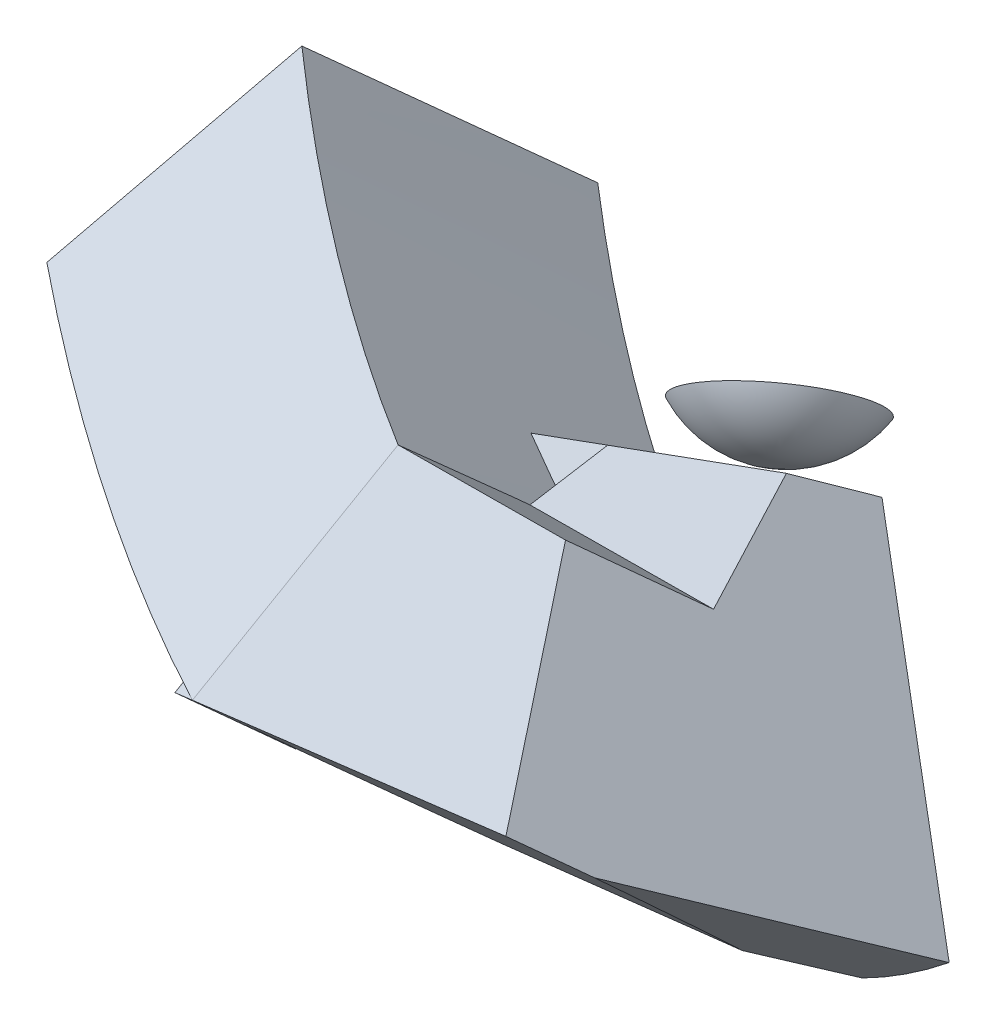
ISO-10303-21;
HEADER;
FILE_DESCRIPTION(('STEP AP214'),'2;1');
FILE_NAME('part.step','',(''),(''),'','','');
FILE_SCHEMA(('AUTOMOTIVE_DESIGN { 1 0 10303 214 1 1 1 1 }'));
ENDSEC;
DATA;
#1=APPLICATION_CONTEXT('core data for automotive mechanical design processes');
#2=APPLICATION_PROTOCOL_DEFINITION('international standard','automotive_design',2000,#1);
#3=PRODUCT_CONTEXT('',#1,'mechanical');
#4=PRODUCT('Part','Part','',(#3));
#5=PRODUCT_RELATED_PRODUCT_CATEGORY('part','',(#4));
#6=PRODUCT_DEFINITION_FORMATION('','',#4);
#7=PRODUCT_DEFINITION_CONTEXT('part definition',#1,'design');
#8=PRODUCT_DEFINITION('design','',#6,#7);
#9=PRODUCT_DEFINITION_SHAPE('','',#8);
#10=(LENGTH_UNIT() NAMED_UNIT(*) SI_UNIT(.MILLI.,.METRE.));
#11=(NAMED_UNIT(*) PLANE_ANGLE_UNIT() SI_UNIT($,.RADIAN.));
#12=(NAMED_UNIT(*) SI_UNIT($,.STERADIAN.) SOLID_ANGLE_UNIT());
#13=UNCERTAINTY_MEASURE_WITH_UNIT(LENGTH_MEASURE(1.E-05),#10,'distance_accuracy_value','');
#14=(GEOMETRIC_REPRESENTATION_CONTEXT(3) GLOBAL_UNCERTAINTY_ASSIGNED_CONTEXT((#13)) GLOBAL_UNIT_ASSIGNED_CONTEXT((#10,
#11,#12)) REPRESENTATION_CONTEXT('',''));
#15=CARTESIAN_POINT('',(0.,0.,0.));
#16=DIRECTION('',(0.,0.,1.));
#17=DIRECTION('',(1.,0.,0.));
#18=AXIS2_PLACEMENT_3D('',#15,#16,#17);
#19=CARTESIAN_POINT('',(-512.21458623228,908.307300803401,4054.79413164876));
#20=DIRECTION('',(0.448319909818911,-0.679127077041244,0.581201919894781));
#21=DIRECTION('',(-0.288113592040315,0.505718117307448,0.813166492121163));
#22=AXIS2_PLACEMENT_3D('',#19,#20,#21);
#23=SPHERICAL_SURFACE('',#22,11.9999999999994);
#24=CARTESIAN_POINT('',(-509.240768378449,903.802481404368,4058.64938904021));
#25=DIRECTION('',(0.448319909818911,-0.679127077041244,0.581201919894781));
#26=DIRECTION('',(0.,-0.650206241957508,-0.759757752786699));
#27=AXIS2_PLACEMENT_3D('',#24,#25,#26);
#28=CIRCLE('',#27,9.9999999999995);
#29=CARTESIAN_POINT('',(-509.240768378449,897.300418984793,4051.05181151235));
#30=VERTEX_POINT('',#29);
#31=EDGE_CURVE('P0_E10',#30,#30,#28,.T.);
#32=ORIENTED_EDGE('',*,*,#31,.T.);
#33=EDGE_LOOP('',(#32));
#34=FACE_BOUND('',#33,.T.);
#35=ADVANCED_FACE('P0_F15',(#34),#23,.T.);
#36=CARTESIAN_POINT('',(-512.121904298853,908.859662577442,4066.78105396142));
#37=DIRECTION('',(0.448319909818911,-0.679127077041244,0.581201919894781));
#38=DIRECTION('',(0.,-0.650206241957508,-0.759757752786699));
#39=AXIS2_PLACEMENT_3D('',#36,#37,#38);
#40=PLANE('',#39);
#41=ORIENTED_EDGE('',*,*,#31,.F.);
#42=EDGE_LOOP('',(#41));
#43=FACE_BOUND('',#42,.T.);
#44=ADVANCED_FACE('P0_F23',(#43),#40,.F.);
#45=CLOSED_SHELL('',(#35,#44));
#46=MANIFOLD_SOLID_BREP('P0_B1',#45);
#47=CARTESIAN_POINT('',(-833.082850345083,2376.22339583199,1397.6069230379));
#48=DIRECTION('',(-0.288202576589418,0.82622503646678,0.484036634938606));
#49=DIRECTION('',(0.,-0.505484619205064,0.86283561571548));
#50=AXIS2_PLACEMENT_3D('',#47,#48,#49);
#51=PLANE('',#50);
#52=CARTESIAN_POINT('',(-528.87399359729,891.91854264907,4112.36756910259));
#53=CARTESIAN_POINT('',(-528.403556927149,891.896041024064,4112.68608314733));
#54=CARTESIAN_POINT('',(-527.931596049871,891.875353123319,4113.0024087958));
#55=CARTESIAN_POINT('',(-526.984625881041,891.837604770354,4113.63068330018));
#56=CARTESIAN_POINT('',(-526.509616589488,891.820544318133,4113.94263215609));
#57=CARTESIAN_POINT('',(-526.033083090799,891.805297590174,4114.25239261572));
#58=B_SPLINE_CURVE_WITH_KNOTS('',3,(#52,#53,#54,#55,#56,#57),.UNSPECIFIED.,.F.,.F.,(4,2,4),(0.,
1.70561800329302,3.41123600658561),.UNSPECIFIED.);
#59=CARTESIAN_POINT('',(-528.573064890401,891.904407346218,4112.57087472598));
#60=VERTEX_POINT('',#59);
#61=CARTESIAN_POINT('',(-526.033083090799,891.805297590173,4114.25239261572));
#62=VERTEX_POINT('',#61);
#63=EDGE_CURVE('P1_E236',#60,#62,#58,.T.);
#64=ORIENTED_EDGE('',*,*,#63,.F.);
#65=DIRECTION('',(-0.00763907318680661,-0.507452326818731,0.86164597171176));
#66=VECTOR('',#65,1.);
#67=CARTESIAN_POINT('',(-528.584492443726,891.145291890328,4113.85984068409));
#68=LINE('',#67,#66);
#69=CARTESIAN_POINT('',(-528.584492443726,891.145291890328,4113.85984068409));
#70=VERTEX_POINT('',#69);
#71=EDGE_CURVE('P1_E156',#60,#70,#68,.T.);
#72=ORIENTED_EDGE('',*,*,#71,.T.);
#73=DIRECTION('',(0.957567718294367,0.247706292734628,0.147328399910497));
#74=VECTOR('',#73,1.);
#75=CARTESIAN_POINT('',(-480.334300183112,903.626786431412,4121.2834656511));
#76=LINE('',#75,#74);
#77=EDGE_CURVE('P1_E239',#70,#62,#76,.T.);
#78=ORIENTED_EDGE('',*,*,#77,.T.);
#79=EDGE_LOOP('',(#64,#72,#78));
#80=FACE_BOUND('',#79,.T.);
#81=ADVANCED_FACE('P1_F16',(#80),#51,.T.);
#82=CARTESIAN_POINT('',(-521.189002197683,882.019294288321,4102.996006564));
#83=DIRECTION('',(-0.876135399921251,-0.411945026758972,-0.250375829371327));
#84=DIRECTION('',(0.425497672250812,-0.904959518933936,0.));
#85=AXIS2_PLACEMENT_3D('',#82,#83,#84);
#86=PLANE('',#85);
#87=DIRECTION('',(0.369702593409668,-0.240871643450661,-0.897385560284732));
#88=VECTOR('',#87,1.);
#89=CARTESIAN_POINT('',(-521.559726110383,883.072388693296,4102.56061046527));
#90=LINE('',#89,#88);
#91=CARTESIAN_POINT('',(-522.582313084415,883.738632883618,4105.04275368252));
#92=VERTEX_POINT('',#91);
#93=CARTESIAN_POINT('',(-522.376395497141,883.604471780759,4104.54292632745));
#94=VERTEX_POINT('',#93);
#95=EDGE_CURVE('P1_E39',#92,#94,#90,.T.);
#96=ORIENTED_EDGE('',*,*,#95,.F.);
#97=DIRECTION('',(-0.462218140377722,0.570374850125397,0.678989632505675));
#98=VECTOR('',#97,1.);
#99=CARTESIAN_POINT('',(-521.189002197683,882.019294288321,4102.996006564));
#100=LINE('',#99,#98);
#101=EDGE_CURVE('P1_E249',#92,#70,#100,.T.);
#102=ORIENTED_EDGE('',*,*,#101,.T.);
#103=ORIENTED_EDGE('',*,*,#71,.F.);
#104=CARTESIAN_POINT('',(-521.189002197684,882.019294288322,4102.996006564));
#105=CARTESIAN_POINT('',(-521.828015691035,882.871940636578,4103.82922964439));
#106=CARTESIAN_POINT('',(-522.467157415289,883.725466396533,4104.6614545388));
#107=CARTESIAN_POINT('',(-523.745700793958,885.434315004411,4106.32385713546));
#108=CARTESIAN_POINT('',(-524.385102448378,886.289637852375,4107.15403483766));
#109=CARTESIAN_POINT('',(-526.30372855818,888.858394300712,4109.64145469654));
#110=CARTESIAN_POINT('',(-527.583348089032,890.574581021217,4111.29554960638));
#111=CARTESIAN_POINT('',(-528.863508195864,892.294591508203,4112.94524487494));
#112=B_SPLINE_CURVE_WITH_KNOTS('',3,(#104,#105,#106,#107,#108,#109,#110,#111),.UNSPECIFIED.,.F.,
.F.,(4,2,2,4),(0.,4.05788582848137,8.11577174966471,16.2317091512372),.UNSPECIFIED.);
#113=EDGE_CURVE('P1_E247',#94,#60,#112,.T.);
#114=ORIENTED_EDGE('',*,*,#113,.F.);
#115=EDGE_LOOP('',(#96,#102,#103,#114));
#116=FACE_BOUND('',#115,.T.);
#117=ADVANCED_FACE('P1_F209',(#116),#86,.T.);
#118=CARTESIAN_POINT('',(104.18712353213,-1092.15959613354,640.858415283076));
#119=DIRECTION('',(-0.0819998212514932,0.859577351067142,-0.504383590977262));
#120=DIRECTION('',(0.,0.506087920948013,0.862481893300096));
#121=AXIS2_PLACEMENT_3D('',#118,#119,#120);
#122=PLANE('',#121);
#123=CARTESIAN_POINT('',(-488.579718278092,872.504566107842,4085.43437387442));
#124=DIRECTION('',(-0.0819998212514932,0.859577351067142,-0.504383590977262));
#125=DIRECTION('',(-0.918683892673464,-0.261399177230708,-0.296125607615149));
#126=AXIS2_PLACEMENT_3D('',#123,#124,#125);
#127=ELLIPSE('',#126,1.09448333379449,1.00000000000003);
#128=CARTESIAN_POINT('',(-489.585202487649,872.218469064895,4085.11026933217));
#129=VERTEX_POINT('',#128);
#130=EDGE_CURVE('P1_E139',#129,#129,#127,.F.);
#131=ORIENTED_EDGE('',*,*,#130,.F.);
#132=EDGE_LOOP('',(#131));
#133=FACE_BOUND('',#132,.T.);
#134=CARTESIAN_POINT('',(-501.462479934908,866.761213657524,4077.74088106097));
#135=DIRECTION('',(0.955164739682771,0.212245775641599,0.206426865473075));
#136=VECTOR('',#135,1.);
#137=LINE('',#134,#136);
#138=CARTESIAN_POINT('',(-501.462479934908,866.761213657524,4077.74088106097));
#139=VERTEX_POINT('',#138);
#140=CARTESIAN_POINT('',(-473.99732031167,872.864207062925,4083.67655537473));
#141=VERTEX_POINT('',#140);
#142=EDGE_CURVE('P1_E158',#139,#141,#137,.T.);
#143=ORIENTED_EDGE('',*,*,#142,.T.);
#144=CARTESIAN_POINT('',(-181.249792145028,364.476801277761,3169.68261740982));
#145=DIRECTION('',(-0.0819998212514932,0.859577351067142,-0.504383590977262));
#146=DIRECTION('',(0.284493144700325,-0.464842455305755,-0.838442092433244));
#147=AXIS2_PLACEMENT_3D('',#144,#145,#146);
#148=ELLIPSE('',#147,1141.52248423801,54.9999999999997);
#149=CARTESIAN_POINT('',(-479.191340199723,878.004856819262,4093.28173462595));
#150=VERTEX_POINT('',#149);
#151=EDGE_CURVE('P1_E133',#141,#150,#148,.F.);
#152=ORIENTED_EDGE('',*,*,#151,.T.);
#153=DIRECTION('',(0.996257713804592,0.056821740568262,-0.0651295438617623));
#154=VECTOR('',#153,1.);
#155=CARTESIAN_POINT('',(212.31300907158,917.444933610301,4048.07519597395));
#156=LINE('',#155,#154);
#157=CARTESIAN_POINT('',(-507.360527333272,876.398222088967,4095.12327249666));
#158=VERTEX_POINT('',#157);
#159=EDGE_CURVE('P1_E253',#158,#150,#156,.T.);
#160=ORIENTED_EDGE('',*,*,#159,.F.);
#161=DIRECTION('',(0.284493144700321,-0.464842455305756,-0.838442092433245));
#162=VECTOR('',#161,1.);
#163=CARTESIAN_POINT('',(626.416181183715,-976.11583237331,753.720734159905));
#164=LINE('',#163,#162);
#165=EDGE_CURVE('P1_E369',#158,#139,#164,.T.);
#166=ORIENTED_EDGE('',*,*,#165,.T.);
#167=EDGE_LOOP('',(#143,#152,#160,#166));
#168=FACE_BOUND('',#167,.T.);
#169=ADVANCED_FACE('P1_F206',(#133,#168),#122,.F.);
#170=CARTESIAN_POINT('',(626.416181183714,-976.11583237331,753.720734159905));
#171=DIRECTION('',(0.0995613497239741,0.884178273414533,-0.456416825350288));
#172=DIRECTION('',(0.284493144700321,-0.464842455305756,-0.838442092433245));
#173=AXIS2_PLACEMENT_3D('',#170,#171,#172);
#174=PLANE('',#173);
#175=CARTESIAN_POINT('',(-167.70231589908,340.697276914296,3131.44647013888));
#176=DIRECTION('',(0.0995613497239741,0.884178273414533,-0.456416825350288));
#177=DIRECTION('',(0.293152904280769,-0.464401511506518,-0.835698875685622));
#178=AXIS2_PLACEMENT_3D('',#175,#176,#177);
#179=ELLIPSE('',#178,1162.3698636846,54.9999999999997);
#180=CARTESIAN_POINT('',(-511.523106333974,866.225877646424,4074.50922540888));
#181=VERTEX_POINT('',#180);
#182=CARTESIAN_POINT('',(-511.730275867598,878.174460773659,4097.61102826794));
#183=VERTEX_POINT('',#182);
#184=EDGE_CURVE('P1_E504',#181,#183,#179,.T.);
#185=ORIENTED_EDGE('',*,*,#184,.F.);
#186=DIRECTION('',(0.950867452567859,0.0505966098879775,0.305435870052869));
#187=VECTOR('',#186,1.);
#188=CARTESIAN_POINT('',(-535.746203059682,864.93694239893,4066.72832744691));
#189=LINE('',#188,#187);
#190=EDGE_CURVE('P1_E371',#139,#181,#189,.F.);
#191=ORIENTED_EDGE('',*,*,#190,.F.);
#192=ORIENTED_EDGE('',*,*,#165,.F.);
#193=DIRECTION('',(0.819411245429362,-0.333078652323059,-0.466501685131529));
#194=VECTOR('',#193,1.);
#195=CARTESIAN_POINT('',(2036.77387962972,-157.755097537409,2646.71382648345));
#196=LINE('',#195,#194);
#197=EDGE_CURVE('P1_E243',#158,#183,#196,.F.);
#198=ORIENTED_EDGE('',*,*,#197,.T.);
#199=EDGE_LOOP('',(#185,#191,#192,#198));
#200=FACE_BOUND('',#199,.T.);
#201=ADVANCED_FACE('P1_F18',(#200),#174,.F.);
#202=CARTESIAN_POINT('',(-1123.26766999078,1971.64183500435,3170.28996949122));
#203=DIRECTION('',(-0.288113592040319,0.505718117307454,0.813166492121158));
#204=DIRECTION('',(0.,-0.84917469231837,0.528112054327489));
#205=AXIS2_PLACEMENT_3D('',#202,#203,#204);
#206=PLANE('',#205);
#207=DIRECTION('',(0.713856549293143,-0.452583404821623,0.534394132369877));
#208=VECTOR('',#207,1.);
#209=CARTESIAN_POINT('',(-497.493840770239,900.845599238658,4057.94951905041));
#210=LINE('',#209,#208);
#211=CARTESIAN_POINT('',(-496.663122902028,900.318926027337,4058.5713957494));
#212=VERTEX_POINT('',#211);
#213=CARTESIAN_POINT('',(-463.715181623168,879.43000729343,4083.23627626429));
#214=VERTEX_POINT('',#213);
#215=EDGE_CURVE('P1_E146',#212,#214,#210,.T.);
#216=ORIENTED_EDGE('',*,*,#215,.T.);
#217=CARTESIAN_POINT('',(-493.759260831532,913.016351340969,4051.70358215101));
#218=DIRECTION('',(-0.288113592040319,0.505718117307454,0.813166492121158));
#219=DIRECTION('',(0.,0.849174692318371,-0.528112054327489));
#220=AXIS2_PLACEMENT_3D('',#217,#218,#219);
#221=CIRCLE('',#220,54.9999999999997);
#222=EDGE_CURVE('P1_E130',#141,#214,#221,.T.);
#223=ORIENTED_EDGE('',*,*,#222,.F.);
#224=ORIENTED_EDGE('',*,*,#142,.F.);
#225=ORIENTED_EDGE('',*,*,#190,.T.);
#226=CARTESIAN_POINT('',(-463.076254963678,993.836260449731,4012.31201652377));
#227=DIRECTION('',(0.288113592040326,-0.505718117307455,-0.813166492121155));
#228=DIRECTION('',(-0.322979009135307,-0.850735885355375,0.414648059234071));
#229=AXIS2_PLACEMENT_3D('',#226,#227,#228);
#230=CIRCLE('',#229,150.000000000001);
#231=CARTESIAN_POINT('',(-553.275422059531,880.373717874749,4050.91721938084));
#232=VERTEX_POINT('',#231);
#233=EDGE_CURVE('P1_E447',#181,#232,#230,.T.);
#234=ORIENTED_EDGE('',*,*,#233,.T.);
#235=DIRECTION('',(-0.182337919390171,-0.862610796518032,0.471863854181468));
#236=VECTOR('',#235,1.);
#237=CARTESIAN_POINT('',(-549.401152556977,898.702251581288,4040.89117682355));
#238=LINE('',#237,#236);
#239=CARTESIAN_POINT('',(-549.401152556977,898.702251581288,4040.89117682355));
#240=VERTEX_POINT('',#239);
#241=EDGE_CURVE('P1_E445',#240,#232,#238,.T.);
#242=ORIENTED_EDGE('',*,*,#241,.F.);
#243=CARTESIAN_POINT('',(-463.076254963678,993.836260449731,4012.31201652377));
#244=DIRECTION('',(0.288113592040326,-0.505718117307455,-0.813166492121155));
#245=DIRECTION('',(-0.390211687000233,-0.837476506303705,0.382580632962221));
#246=AXIS2_PLACEMENT_3D('',#243,#244,#245);
#247=CIRCLE('',#246,131.602568330999);
#248=CARTESIAN_POINT('',(-526.59634348304,887.223890088536,4056.10969719039));
#249=VERTEX_POINT('',#248);
#250=EDGE_CURVE('P1_E448',#249,#240,#247,.T.);
#251=ORIENTED_EDGE('',*,*,#250,.F.);
#252=DIRECTION('',(-0.913576273454865,-0.399666788321248,-0.0751322227363184));
#253=VECTOR('',#252,1.);
#254=CARTESIAN_POINT('',(-517.909962107295,891.023964857829,4056.82406243746));
#255=LINE('',#254,#253);
#256=EDGE_CURVE('P1_E154',#212,#249,#255,.T.);
#257=ORIENTED_EDGE('',*,*,#256,.F.);
#258=EDGE_LOOP('',(#216,#223,#224,#225,#234,#242,#251,#257));
#259=FACE_BOUND('',#258,.T.);
#260=ADVANCED_FACE('P1_F152',(#259),#206,.F.);
#261=CARTESIAN_POINT('',(419.938134195095,121.369103599562,75.2013869893931));
#262=DIRECTION('',(0.946773045866867,0.273633153391361,0.169545560204549));
#263=DIRECTION('',(-0.277652915022809,0.960681455415549,0.));
#264=AXIS2_PLACEMENT_3D('',#261,#262,#263);
#265=PLANE('',#264);
#266=DIRECTION('',(0.0942666535583485,0.267927716114594,-0.958816216469313));
#267=VECTOR('',#266,1.);
#268=CARTESIAN_POINT('',(-518.394033848754,904.22786185659,4051.54552291641));
#269=LINE('',#268,#267);
#270=CARTESIAN_POINT('',(-520.964667375623,896.92152452708,4077.69225687928));
#271=VERTEX_POINT('',#270);
#272=CARTESIAN_POINT('',(-520.106195822439,899.361499999968,4068.96046874956));
#273=VERTEX_POINT('',#272);
#274=EDGE_CURVE('P1_E370',#271,#273,#269,.T.);
#275=ORIENTED_EDGE('',*,*,#274,.T.);
#276=DIRECTION('',(0.126886649253684,-0.801291665801454,0.584663531065777));
#277=VECTOR('',#276,1.);
#278=CARTESIAN_POINT('',(-722.151282662744,2175.28016562402,3137.98471518253));
#279=LINE('',#278,#277);
#280=CARTESIAN_POINT('',(-519.111865568576,893.082285045825,4073.54210630315));
#281=VERTEX_POINT('',#280);
#282=EDGE_CURVE('P1_E430',#273,#281,#279,.T.);
#283=ORIENTED_EDGE('',*,*,#282,.T.);
#284=DIRECTION('',(0.30888674232443,-0.624012428153399,-0.717772575351205));
#285=VECTOR('',#284,1.);
#286=CARTESIAN_POINT('',(-525.810153885737,906.614154771955,4089.10718889515));
#287=LINE('',#286,#285);
#288=CARTESIAN_POINT('',(-520.966072992619,896.8281514701,4077.85080284342));
#289=VERTEX_POINT('',#288);
#290=EDGE_CURVE('P1_E453',#289,#281,#287,.T.);
#291=ORIENTED_EDGE('',*,*,#290,.F.);
#292=DIRECTION('',(-0.00763907318680562,-0.507452326818719,0.861645971711767));
#293=VECTOR('',#292,1.);
#294=CARTESIAN_POINT('',(-520.864532734399,903.573320555412,4066.39761312744));
#295=LINE('',#294,#293);
#296=EDGE_CURVE('P1_E155',#271,#289,#295,.T.);
#297=ORIENTED_EDGE('',*,*,#296,.F.);
#298=EDGE_LOOP('',(#275,#283,#291,#297));
#299=FACE_BOUND('',#298,.T.);
#300=ADVANCED_FACE('P1_F197',(#299),#265,.F.);
#301=CARTESIAN_POINT('',(-289.350185713788,-345.888381447321,93.5848294694436));
#302=DIRECTION('',(-0.628250037955901,-0.751008292034525,0.203195558769855));
#303=DIRECTION('',(0.767009510548327,-0.64163573055778,0.));
#304=AXIS2_PLACEMENT_3D('',#301,#302,#303);
#305=PLANE('',#304);
#306=DIRECTION('',(-0.462218140377722,0.570374850125397,0.678989632505675));
#307=VECTOR('',#306,1.);
#308=CARTESIAN_POINT('',(-472.938809937068,894.500788829406,4110.41963153101));
#309=LINE('',#308,#307);
#310=CARTESIAN_POINT('',(-475.909646084001,898.16678562622,4114.78373316923));
#311=VERTEX_POINT('',#310);
#312=CARTESIAN_POINT('',(-480.334300183112,903.626786431412,4121.2834656511));
#313=VERTEX_POINT('',#312);
#314=EDGE_CURVE('P1_E148',#311,#313,#309,.T.);
#315=ORIENTED_EDGE('',*,*,#314,.F.);
#316=CARTESIAN_POINT('',(-384.248652325663,720.795295865629,3742.62285903015));
#317=DIRECTION('',(-0.628250037955901,-0.751008292034525,0.203195558769855));
#318=DIRECTION('',(0.30937148679168,-0.480785614359927,-0.820447729099699));
#319=AXIS2_PLACEMENT_3D('',#316,#317,#318);
#320=ELLIPSE('',#319,1638.88973757033,54.9999999999997);
#321=EDGE_CURVE('P1_E31',#311,#214,#320,.F.);
#322=ORIENTED_EDGE('',*,*,#321,.T.);
#323=ORIENTED_EDGE('',*,*,#215,.F.);
#324=DIRECTION('',(-0.323564763392717,0.489727360982533,0.809612843151403));
#325=VECTOR('',#324,1.);
#326=CARTESIAN_POINT('',(761.190049203996,-1003.48885582106,911.213592453165));
#327=LINE('',#326,#325);
#328=CARTESIAN_POINT('',(-500.029043965054,905.41337334041,4066.99348996351));
#329=VERTEX_POINT('',#328);
#330=EDGE_CURVE('P1_E356',#212,#329,#327,.T.);
#331=ORIENTED_EDGE('',*,*,#330,.T.);
#332=DIRECTION('',(0.422488517502392,-0.110012210276053,0.899667030722372));
#333=VECTOR('',#332,1.);
#334=CARTESIAN_POINT('',(-627.100422893378,938.501617587549,3796.4016858452));
#335=LINE('',#334,#333);
#336=CARTESIAN_POINT('',(-492.072604459313,903.341588049939,4083.93630854606));
#337=VERTEX_POINT('',#336);
#338=EDGE_CURVE('P1_E362',#329,#337,#335,.T.);
#339=ORIENTED_EDGE('',*,*,#338,.T.);
#340=DIRECTION('',(-0.462218140377722,0.570374850125397,0.678989632505675));
#341=VECTOR('',#340,1.);
#342=CARTESIAN_POINT('',(-492.072604459313,903.341588049939,4083.93630854606));
#343=LINE('',#342,#341);
#344=CARTESIAN_POINT('',(-499.468094705356,912.467585651945,4094.80014266615));
#345=VERTEX_POINT('',#344);
#346=EDGE_CURVE('P1_E264',#337,#345,#343,.T.);
#347=ORIENTED_EDGE('',*,*,#346,.T.);
#348=DIRECTION('',(-0.565300349906988,0.261197897103708,-0.782439245528774));
#349=VECTOR('',#348,1.);
#350=CARTESIAN_POINT('',(-499.468094705356,912.467585651945,4094.80014266615));
#351=LINE('',#350,#349);
#352=EDGE_CURVE('P1_E262',#313,#345,#351,.T.);
#353=ORIENTED_EDGE('',*,*,#352,.F.);
#354=EDGE_LOOP('',(#315,#322,#323,#331,#339,#347,#353));
#355=FACE_BOUND('',#354,.T.);
#356=ADVANCED_FACE('P1_F144',(#355),#305,.F.);
#357=CARTESIAN_POINT('',(-1031.50590847144,783.474893583184,3967.35586807042));
#358=DIRECTION('',(-0.259149661481702,0.936506226224043,0.236215031692568));
#359=DIRECTION('',(0.955164739682765,0.212245775641613,0.206426865473093));
#360=AXIS2_PLACEMENT_3D('',#357,#358,#359);
#361=PLANE('',#360);
#362=DIRECTION('',(0.953263773333673,0.287343128010711,-0.0933922118523109));
#363=VECTOR('',#362,1.);
#364=CARTESIAN_POINT('',(-1007.51850566025,752.440383665151,4116.71274359014));
#365=LINE('',#364,#363);
#366=EDGE_CURVE('P1_E166',#273,#329,#365,.T.);
#367=ORIENTED_EDGE('',*,*,#366,.F.);
#368=ORIENTED_EDGE('',*,*,#274,.F.);
#369=DIRECTION('',(-0.955164739682765,-0.212245775641613,-0.206426865473093));
#370=VECTOR('',#369,1.);
#371=CARTESIAN_POINT('',(-521.751777775998,896.74662186317,4077.52214933031));
#372=LINE('',#371,#370);
#373=EDGE_CURVE('P1_E367',#337,#271,#372,.T.);
#374=ORIENTED_EDGE('',*,*,#373,.F.);
#375=ORIENTED_EDGE('',*,*,#338,.F.);
#376=EDGE_LOOP('',(#367,#368,#374,#375));
#377=FACE_BOUND('',#376,.T.);
#378=ADVANCED_FACE('P1_F205',(#377),#361,.T.);
#379=CARTESIAN_POINT('',(-526.033083090799,891.805297590174,4114.25239261572));
#380=CARTESIAN_POINT('',(-525.810153885737,906.614154771955,4089.10718889515));
#381=(BOUNDED_CURVE() B_SPLINE_CURVE(1,(#379,#380),.UNSPECIFIED.,.F.,
.F.) B_SPLINE_CURVE_WITH_KNOTS((2,2),(0.,1.),
.UNSPECIFIED.) CURVE() GEOMETRIC_REPRESENTATION_ITEM() RATIONAL_B_SPLINE_CURVE((1.,1.)) REPRESENTATION_ITEM(''));
#382=CARTESIAN_POINT('',(-525.810153885737,906.614154771955,4089.10718889514));
#383=VERTEX_POINT('',#382);
#384=EDGE_CURVE('P1_E364',#62,#383,#381,.T.);
#385=ORIENTED_EDGE('',*,*,#384,.F.);
#386=EDGE_CURVE('P1_E252',#62,#313,#76,.T.);
#387=ORIENTED_EDGE('',*,*,#386,.T.);
#388=ORIENTED_EDGE('',*,*,#352,.T.);
#389=DIRECTION('',(-0.955164739682764,-0.212245775641613,-0.206426865473096));
#390=VECTOR('',#389,1.);
#391=CARTESIAN_POINT('',(-528.360157621667,906.047522129086,4088.55609099937));
#392=LINE('',#391,#390);
#393=EDGE_CURVE('P1_E267',#345,#383,#392,.T.);
#394=ORIENTED_EDGE('',*,*,#393,.T.);
#395=EDGE_LOOP('',(#385,#387,#388,#394));
#396=FACE_BOUND('',#395,.T.);
#397=ADVANCED_FACE('P1_F198',(#396),#51,.T.);
#398=CARTESIAN_POINT('',(-472.938809937068,894.500788829406,4110.41963153101));
#399=DIRECTION('',(0.0859160636638609,-0.733284799105662,0.674471521567128));
#400=DIRECTION('',(0.,-0.676974717634247,-0.736006271497758));
#401=AXIS2_PLACEMENT_3D('',#398,#399,#400);
#402=PLANE('',#401);
#403=CARTESIAN_POINT('',(-597.358744123355,1094.86176610722,4344.10085441225));
#404=DIRECTION('',(0.0859160636638609,-0.733284799105662,0.674471521567128));
#405=DIRECTION('',(0.304830282296517,-0.625162206666617,-0.718505890268655));
#406=AXIS2_PLACEMENT_3D('',#403,#404,#405);
#407=ELLIPSE('',#406,359.786005269645,54.9999999999997);
#408=EDGE_CURVE('P1_E10',#311,#150,#407,.F.);
#409=ORIENTED_EDGE('',*,*,#408,.F.);
#410=ORIENTED_EDGE('',*,*,#314,.T.);
#411=ORIENTED_EDGE('',*,*,#386,.F.);
#412=ORIENTED_EDGE('',*,*,#77,.F.);
#413=ORIENTED_EDGE('',*,*,#101,.F.);
#414=DIRECTION('',(0.227473650909249,-0.644655913129009,-0.729845525991507));
#415=VECTOR('',#414,1.);
#416=CARTESIAN_POINT('',(-522.484405878526,883.461165761771,4104.72861999761));
#417=LINE('',#416,#415);
#418=CARTESIAN_POINT('',(-524.342916787374,888.728149617768,4110.69162215812));
#419=VERTEX_POINT('',#418);
#420=EDGE_CURVE('P1_E149',#419,#92,#417,.T.);
#421=ORIENTED_EDGE('',*,*,#420,.F.);
#422=EDGE_CURVE('P1_E25',#183,#419,#407,.F.);
#423=ORIENTED_EDGE('',*,*,#422,.F.);
#424=ORIENTED_EDGE('',*,*,#197,.F.);
#425=ORIENTED_EDGE('',*,*,#159,.T.);
#426=EDGE_LOOP('',(#409,#410,#411,#412,#413,#421,#423,#424,#425));
#427=FACE_BOUND('',#426,.T.);
#428=ADVANCED_FACE('P1_F219',(#427),#402,.T.);
#429=CARTESIAN_POINT('',(-520.964667375623,896.921524527079,4077.69225687928));
#430=DIRECTION('',(-0.0268112483176432,0.756352833101864,-0.653614220180707));
#431=DIRECTION('',(0.,0.653849269926524,0.756624829236096));
#432=AXIS2_PLACEMENT_3D('',#429,#430,#431);
#433=PLANE('',#432);
#434=CARTESIAN_POINT('',(-525.810153885737,906.614154771955,4089.10718889515));
#435=CARTESIAN_POINT('',(-525.047807383271,904.982906855166,4087.18826117599));
#436=CARTESIAN_POINT('',(-524.286012697629,903.351538619036,4085.26921686058));
#437=CARTESIAN_POINT('',(-522.763526959992,900.088561508093,4081.43089503721));
#438=CARTESIAN_POINT('',(-522.002835907997,898.456952633281,4079.51161752927));
#439=CARTESIAN_POINT('',(-521.242696672826,896.825223439128,4077.59222342506));
#440=B_SPLINE_CURVE_WITH_KNOTS('',3,(#434,#435,#436,#437,#438,#439),.UNSPECIFIED.,.F.,.F.,(4,2,
4),(0.,7.89429040162164,15.7885808032431),.UNSPECIFIED.);
#441=CARTESIAN_POINT('',(-521.724344471457,897.858962225491,4078.80820804403));
#442=VERTEX_POINT('',#441);
#443=EDGE_CURVE('P1_E244',#383,#442,#440,.T.);
#444=ORIENTED_EDGE('',*,*,#443,.F.);
#445=ORIENTED_EDGE('',*,*,#393,.F.);
#446=ORIENTED_EDGE('',*,*,#346,.F.);
#447=ORIENTED_EDGE('',*,*,#373,.T.);
#448=DIRECTION('',(-0.462218140377722,0.570374850125397,0.678989632505675));
#449=VECTOR('',#448,1.);
#450=CARTESIAN_POINT('',(-520.964667375623,896.921524527079,4077.69225687928));
#451=LINE('',#450,#449);
#452=EDGE_CURVE('P1_E161',#271,#442,#451,.T.);
#453=ORIENTED_EDGE('',*,*,#452,.T.);
#454=EDGE_LOOP('',(#444,#445,#446,#447,#453));
#455=FACE_BOUND('',#454,.T.);
#456=ADVANCED_FACE('P1_F224',(#455),#433,.T.);
#457=CARTESIAN_POINT('',(-527.974327901566,906.393333120548,4086.63699922658));
#458=CARTESIAN_POINT('',(-527.584597321768,905.858964619655,4086.15242245534));
#459=CARTESIAN_POINT('',(-527.194931238906,905.3251075118,4085.66722997862));
#460=CARTESIAN_POINT('',(-526.415729755107,904.258402557656,4084.69564177316));
#461=CARTESIAN_POINT('',(-526.02619435328,903.725554704367,4084.20924605282));
#462=CARTESIAN_POINT('',(-525.247251792421,902.660849070877,4083.23527439587));
#463=CARTESIAN_POINT('',(-524.857844632967,902.128991287377,4082.74769846319));
#464=CARTESIAN_POINT('',(-524.079156292238,901.066247479612,4081.77138858893));
#465=CARTESIAN_POINT('',(-523.689875110942,900.535361455181,4081.28265464755));
#466=CARTESIAN_POINT('',(-522.911436261136,899.47454298387,4080.30405004321));
#467=CARTESIAN_POINT('',(-522.522278593065,898.944610540345,4079.81417937627));
#468=CARTESIAN_POINT('',(-521.744084477785,897.885681862025,4078.83332187778));
#469=CARTESIAN_POINT('',(-521.355048031413,897.356685633573,4078.34233503871));
#470=CARTESIAN_POINT('',(-520.966072992619,896.8281514701,4077.85080284342));
#471=B_SPLINE_CURVE_WITH_KNOTS('',3,(#457,#458,#459,#460,#461,#462,#463,#464,#465,#466,#467,
#468,#469,#470),.UNSPECIFIED.,.F.,.F.,(4,2,2,2,2,2,4),(0.,2.45973291395728,4.91944870006595,
7.37915627343171,9.8388634246592,12.2985792107355,14.7583115967618),.UNSPECIFIED.);
#472=EDGE_CURVE('P1_E389',#442,#289,#471,.T.);
#473=ORIENTED_EDGE('',*,*,#472,.F.);
#474=ORIENTED_EDGE('',*,*,#452,.F.);
#475=ORIENTED_EDGE('',*,*,#296,.T.);
#476=EDGE_LOOP('',(#473,#474,#475));
#477=FACE_BOUND('',#476,.T.);
#478=ADVANCED_FACE('P1_F213',(#477),#86,.T.);
#479=CARTESIAN_POINT('',(854.488110236973,197.172023329151,182.024338387473));
#480=DIRECTION('',(-0.939070348780757,0.0105648554713704,-0.343562605458824));
#481=DIRECTION('',(0.0145287169516258,-0.99741421993568,-0.0703831674041389));
#482=AXIS2_PLACEMENT_3D('',#479,#480,#481);
#483=PLANE('',#482);
#484=ORIENTED_EDGE('',*,*,#241,.T.);
#485=DIRECTION('',(-0.299801479390787,0.463719616042588,0.833716492971328));
#486=VECTOR('',#485,1.);
#487=CARTESIAN_POINT('',(-553.27542205953,880.373717874749,4050.91721938084));
#488=LINE('',#487,#486);
#489=CARTESIAN_POINT('',(-563.461431577017,896.128985100425,4079.24344428656));
#490=VERTEX_POINT('',#489);
#491=EDGE_CURVE('P1_E451',#232,#490,#488,.T.);
#492=ORIENTED_EDGE('',*,*,#491,.T.);
#493=DIRECTION('',(-0.260072661407084,0.631695260128468,0.730289880198174));
#494=VECTOR('',#493,1.);
#495=CARTESIAN_POINT('',(-563.461431577017,896.128985100425,4079.24344428656));
#496=LINE('',#495,#494);
#497=CARTESIAN_POINT('',(-567.539991247346,906.035473533154,4090.69613153523));
#498=VERTEX_POINT('',#497);
#499=EDGE_CURVE('P1_E458',#490,#498,#496,.T.);
#500=ORIENTED_EDGE('',*,*,#499,.T.);
#501=DIRECTION('',(0.293199579574673,0.546274943586414,-0.784613084613617));
#502=VECTOR('',#501,1.);
#503=CARTESIAN_POINT('',(-567.539991247346,906.035473533154,4090.69613153523));
#504=LINE('',#503,#502);
#505=CARTESIAN_POINT('',(-558.983619603729,921.977281647962,4067.79895972435));
#506=VERTEX_POINT('',#505);
#507=EDGE_CURVE('P1_E461',#498,#506,#504,.T.);
#508=ORIENTED_EDGE('',*,*,#507,.T.);
#509=DIRECTION('',(0.260072661407086,-0.631695260128464,-0.730289880198177));
#510=VECTOR('',#509,1.);
#511=CARTESIAN_POINT('',(-558.983619603729,921.977281647962,4067.79895972435));
#512=LINE('',#511,#510);
#513=EDGE_CURVE('P1_E292',#506,#240,#512,.T.);
#514=ORIENTED_EDGE('',*,*,#513,.T.);
#515=EDGE_LOOP('',(#484,#492,#500,#508,#514));
#516=FACE_BOUND('',#515,.T.);
#517=ADVANCED_FACE('P1_F223',(#516),#483,.T.);
#518=CARTESIAN_POINT('',(-511.523106333974,866.225877646424,4074.50922540888));
#519=CARTESIAN_POINT('',(-526.689271959575,868.634502898637,4067.63773729684));
#520=CARTESIAN_POINT('',(-540.737704703985,873.394837229139,4059.69971747133));
#521=CARTESIAN_POINT('',(-553.27542205953,880.373717874749,4050.91721938084));
#522=CARTESIAN_POINT('',(-521.189002197683,882.019294288322,4102.996006564));
#523=CARTESIAN_POINT('',(-536.530536837767,884.38895104541,4096.08661831342));
#524=CARTESIAN_POINT('',(-550.753972610334,889.136449213444,4088.09457600718));
#525=CARTESIAN_POINT('',(-563.461431577016,896.128985100425,4079.24344428656));
#526=(BOUNDED_SURFACE() B_SPLINE_SURFACE(1,3,((#518,#519,#520,#521),(#522,#523,#524,#525)),
.UNSPECIFIED.,.F.,.F.,.F.) B_SPLINE_SURFACE_WITH_KNOTS((2,2),(4,4),(0.,1.),(0.,1.),
.UNSPECIFIED.) GEOMETRIC_REPRESENTATION_ITEM() RATIONAL_B_SPLINE_SURFACE(((1.,0.990675531455513,
0.990675531455513,1.),(1.,0.990675531455513,0.990675531455513,1.))) REPRESENTATION_ITEM('') SURFACE());
#527=CARTESIAN_POINT('',(-521.79069957837,882.113554733181,4102.7241970262));
#528=CARTESIAN_POINT('',(-520.934856965041,880.789418020291,4100.37243040627));
#529=CARTESIAN_POINT('',(-520.079023571922,879.465255697926,4098.02067485013));
#530=CARTESIAN_POINT('',(-518.367375365843,876.816879447664,4093.31718603368));
#531=CARTESIAN_POINT('',(-517.511560552884,875.492665519767,4090.96545277337));
#532=CARTESIAN_POINT('',(-514.944834582207,871.521014027863,4083.91218385042));
#533=CARTESIAN_POINT('',(-513.233951474144,868.873498559553,4079.21068184763));
#534=CARTESIAN_POINT('',(-511.523106333974,866.225877646424,4074.50922540888));
#535=B_SPLINE_CURVE_WITH_KNOTS('',3,(#527,#528,#529,#530,#531,#532,#533,#534),.UNSPECIFIED.,.F.,
.F.,(4,2,2,4),(0.,8.49408603835772,16.9881720767224,33.9694918741256),.UNSPECIFIED.);
#536=CARTESIAN_POINT('',(-521.79069957837,882.113554733181,4102.7241970262));
#537=VERTEX_POINT('',#536);
#538=EDGE_CURVE('P1_E333',#537,#181,#535,.T.);
#539=CARTESIAN_POINT('',(-472.85378984498,1010.9985071076,4039.90795076872));
#540=DIRECTION('',(0.288113592040326,-0.505718117307455,-0.813166492121155));
#541=DIRECTION('',(-0.319045815014135,-0.851351966213228,0.41642478017865));
#542=AXIS2_PLACEMENT_3D('',#539,#540,#541);
#543=CIRCLE('',#542,151.499283419722);
#544=EDGE_CURVE('P1_E456',#537,#490,#543,.T.);
#545=ORIENTED_EDGE('',*,*,#538,.F.);
#546=ORIENTED_EDGE('',*,*,#544,.T.);
#547=ORIENTED_EDGE('',*,*,#491,.F.);
#548=ORIENTED_EDGE('',*,*,#233,.F.);
#549=EDGE_LOOP('',(#545,#546,#547,#548));
#550=FACE_BOUND('',#549,.T.);
#551=ADVANCED_FACE('P1_F302',(#550),#526,.T.);
#552=CARTESIAN_POINT('',(-521.189002197683,882.019294288322,4102.996006564));
#553=CARTESIAN_POINT('',(-536.530536837767,884.38895104541,4096.08661831342));
#554=CARTESIAN_POINT('',(-550.753972610334,889.136449213444,4088.09457600718));
#555=CARTESIAN_POINT('',(-563.461431577016,896.128985100425,4079.24344428656));
#556=CARTESIAN_POINT('',(-526.033083090799,891.805297590174,4114.25239261572));
#557=CARTESIAN_POINT('',(-541.120572043743,894.253007310625,4107.38447338546));
#558=CARTESIAN_POINT('',(-555.086432320775,899.041045200311,4099.45848068905));
#559=CARTESIAN_POINT('',(-567.539991247346,906.035473533154,4090.69613153523));
#560=(BOUNDED_SURFACE() B_SPLINE_SURFACE(1,3,((#552,#553,#554,#555),(#556,#557,#558,#559)),
.UNSPECIFIED.,.F.,.F.,.F.) B_SPLINE_SURFACE_WITH_KNOTS((2,2),(4,4),(0.,1.),(0.,1.),
.UNSPECIFIED.) GEOMETRIC_REPRESENTATION_ITEM() RATIONAL_B_SPLINE_SURFACE(((1.,0.990675531455513,
0.990675531455513,1.),(1.,0.990675531455513,0.990675531455513,1.))) REPRESENTATION_ITEM('') SURFACE());
#561=CARTESIAN_POINT('',(-523.928404423877,887.553429622176,4109.36166595107));
#562=CARTESIAN_POINT('',(-523.61239923121,886.749640798916,4108.38061345784));
#563=CARTESIAN_POINT('',(-523.296427949022,885.945779511971,4107.39960943117));
#564=CARTESIAN_POINT('',(-522.58384012765,884.132529636559,4105.18709186267));
#565=CARTESIAN_POINT('',(-522.187243128002,883.123099293839,4103.95560624772));
#566=CARTESIAN_POINT('',(-521.79069957837,882.113554733182,4102.72419702619));
#567=B_SPLINE_CURVE_WITH_KNOTS('',3,(#561,#562,#563,#564,#565,#566),.UNSPECIFIED.,.F.,.F.,(4,2,
4),(0.,3.92117297265841,8.8440949252055),.UNSPECIFIED.);
#568=EDGE_CURVE('P1_E317',#94,#537,#567,.T.);
#569=CARTESIAN_POINT('',(-477.318951438849,1018.83608637185,4052.51034055647));
#570=DIRECTION('',(0.288113592040326,-0.505718117307455,-0.813166492121155));
#571=DIRECTION('',(-0.326053387027171,-0.850242373915775,0.413251853481841));
#572=AXIS2_PLACEMENT_3D('',#569,#570,#571);
#573=CIRCLE('',#572,149.405384486591);
#574=EDGE_CURVE('P1_E460',#62,#498,#573,.T.);
#575=ORIENTED_EDGE('',*,*,#568,.F.);
#576=ORIENTED_EDGE('',*,*,#113,.T.);
#577=ORIENTED_EDGE('',*,*,#63,.T.);
#578=ORIENTED_EDGE('',*,*,#574,.T.);
#579=ORIENTED_EDGE('',*,*,#499,.F.);
#580=ORIENTED_EDGE('',*,*,#544,.F.);
#581=EDGE_LOOP('',(#575,#576,#577,#578,#579,#580));
#582=FACE_BOUND('',#581,.T.);
#583=ADVANCED_FACE('P1_F294',(#582),#560,.T.);
#584=CARTESIAN_POINT('',(-526.033083090799,891.805297590174,4114.25239261572));
#585=CARTESIAN_POINT('',(-541.120572043743,894.253007310625,4107.38447338546));
#586=CARTESIAN_POINT('',(-555.086432320775,899.041045200311,4099.45848068905));
#587=CARTESIAN_POINT('',(-567.539991247346,906.035473533154,4090.69613153523));
#588=CARTESIAN_POINT('',(-525.810153885737,906.614154771955,4089.10718889515));
#589=CARTESIAN_POINT('',(-538.120811301278,909.854073240946,4082.73044655888));
#590=CARTESIAN_POINT('',(-549.28271199923,915.023315974213,4075.56085083212));
#591=CARTESIAN_POINT('',(-558.983619603728,921.977281647962,4067.79895972435));
#592=(BOUNDED_SURFACE() B_SPLINE_SURFACE(1,3,((#584,#585,#586,#587),(#588,#589,#590,#591)),
.UNSPECIFIED.,.F.,.F.,.F.) B_SPLINE_SURFACE_WITH_KNOTS((2,2),(4,4),(0.,1.),(0.,1.),
.UNSPECIFIED.) GEOMETRIC_REPRESENTATION_ITEM() RATIONAL_B_SPLINE_SURFACE(((1.,0.990675531455513,
0.990675531455513,1.),(1.,0.990675531455513,0.990675531455513,1.))) REPRESENTATION_ITEM('') SURFACE());
#593=CARTESIAN_POINT('',(-473.567032907405,1012.25044366553,4041.92099484274));
#594=DIRECTION('',(0.288113592040326,-0.505718117307455,-0.813166492121155));
#595=DIRECTION('',(-0.411543004209147,-0.832145455146106,0.371707273491102));
#596=AXIS2_PLACEMENT_3D('',#593,#594,#595);
#597=CIRCLE('',#596,126.944500195614);
#598=EDGE_CURVE('P1_E462',#383,#506,#597,.T.);
#599=ORIENTED_EDGE('',*,*,#598,.T.);
#600=ORIENTED_EDGE('',*,*,#507,.F.);
#601=ORIENTED_EDGE('',*,*,#574,.F.);
#602=ORIENTED_EDGE('',*,*,#384,.T.);
#603=EDGE_LOOP('',(#599,#600,#601,#602));
#604=FACE_BOUND('',#603,.T.);
#605=ADVANCED_FACE('P1_F301',(#604),#592,.T.);
#606=CARTESIAN_POINT('',(-525.810153885737,906.614154771955,4089.10718889515));
#607=CARTESIAN_POINT('',(-538.120811301278,909.854073240946,4082.73044655888));
#608=CARTESIAN_POINT('',(-549.28271199923,915.023315974213,4075.56085083212));
#609=CARTESIAN_POINT('',(-558.983619603728,921.977281647962,4067.79895972435));
#610=CARTESIAN_POINT('',(-514.42911516568,883.622201303291,4062.6606104153));
#611=CARTESIAN_POINT('',(-527.336646140065,886.678736418897,4056.18643772304));
#612=CARTESIAN_POINT('',(-539.103713587438,891.752732158565,4048.86166020153));
#613=CARTESIAN_POINT('',(-549.401152556977,898.702251581287,4040.89117682355));
#614=(BOUNDED_SURFACE() B_SPLINE_SURFACE(1,3,((#606,#607,#608,#609),(#610,#611,#612,#613)),
.UNSPECIFIED.,.F.,.F.,.F.) B_SPLINE_SURFACE_WITH_KNOTS((2,2),(4,4),(0.,1.),(0.,1.),
.UNSPECIFIED.) GEOMETRIC_REPRESENTATION_ITEM() RATIONAL_B_SPLINE_SURFACE(((1.,0.990675531455513,
0.990675531455513,1.),(1.,0.990675531455513,0.990675531455513,1.))) REPRESENTATION_ITEM('') SURFACE());
#615=CARTESIAN_POINT('',(-539.7501084929,902.102583002819,4064.7241797867));
#616=CARTESIAN_POINT('',(-538.134399450521,901.222147681931,4065.53844816611));
#617=CARTESIAN_POINT('',(-536.491650179591,900.373427113843,4066.3333082695));
#618=CARTESIAN_POINT('',(-533.159120079259,898.742554504556,4067.88115882322));
#619=CARTESIAN_POINT('',(-531.469442987414,897.960269072904,4068.63423206686));
#620=CARTESIAN_POINT('',(-528.029141682506,896.455522471563,4070.10492547429));
#621=CARTESIAN_POINT('',(-526.278126726771,895.73361458224,4070.82219762263));
#622=CARTESIAN_POINT('',(-522.728759650648,894.356806378429,4072.21459558395));
#623=CARTESIAN_POINT('',(-520.930316674113,893.702048511284,4072.88963066266));
#624=CARTESIAN_POINT('',(-519.111865568576,893.082285045824,4073.54210630315));
#625=B_SPLINE_CURVE_WITH_KNOTS('',3,(#615,#616,#617,#618,#619,#620,#621,#622,#623,#624),
.UNSPECIFIED.,.F.,.F.,(4,2,2,2,4),(0.,6.03587408108075,12.059327571041,18.1330111818438,
24.2193235715745),.UNSPECIFIED.);
#626=CARTESIAN_POINT('',(-528.722872053216,896.76416779196,4069.80465319726));
#627=VERTEX_POINT('',#626);
#628=EDGE_CURVE('P1_E421',#627,#281,#625,.T.);
#629=CARTESIAN_POINT('',(-526.59634348304,887.223890088536,4056.10969719039));
#630=CARTESIAN_POINT('',(-526.805944478337,888.16008274603,4057.45404996055));
#631=CARTESIAN_POINT('',(-527.015299408071,889.096354931566,4058.79838571862));
#632=CARTESIAN_POINT('',(-527.433503653694,890.969062496968,4061.48702198786));
#633=CARTESIAN_POINT('',(-527.64235296964,891.905497876815,4062.83132249903));
#634=CARTESIAN_POINT('',(-528.059532641141,893.778536579357,4065.51988792788));
#635=CARTESIAN_POINT('',(-528.267862996471,894.715139902124,4066.86415284554));
#636=CARTESIAN_POINT('',(-528.683990442366,896.588518666834,4069.55264550652));
#637=CARTESIAN_POINT('',(-528.891787532871,897.525294108797,4070.89687324984));
#638=CARTESIAN_POINT('',(-529.099310861254,898.462157798236,4072.24108175884));
#639=B_SPLINE_CURVE_WITH_KNOTS('',3,(#629,#630,#631,#632,#633,#634,#635,#636,#637,#638),
.UNSPECIFIED.,.F.,.F.,(4,2,2,2,4),(0.,4.95470106298577,9.90940158269107,14.8641042448956,
19.8188074503815),.UNSPECIFIED.);
#640=EDGE_CURVE('P1_E168',#249,#627,#639,.T.);
#641=ORIENTED_EDGE('',*,*,#628,.F.);
#642=ORIENTED_EDGE('',*,*,#640,.F.);
#643=ORIENTED_EDGE('',*,*,#250,.T.);
#644=ORIENTED_EDGE('',*,*,#513,.F.);
#645=ORIENTED_EDGE('',*,*,#598,.F.);
#646=ORIENTED_EDGE('',*,*,#443,.T.);
#647=ORIENTED_EDGE('',*,*,#472,.T.);
#648=ORIENTED_EDGE('',*,*,#290,.T.);
#649=EDGE_LOOP('',(#641,#642,#643,#644,#645,#646,#647,#648));
#650=FACE_BOUND('',#649,.T.);
#651=ADVANCED_FACE('P1_F221',(#650),#614,.T.);
#652=CARTESIAN_POINT('',(-525.112801908303,903.666917790516,4077.15322474049));
#653=DIRECTION('',(0.286999914045182,-0.764536228140944,0.577161507030811));
#654=DIRECTION('',(0.,-0.602508681044501,-0.798112328726988));
#655=AXIS2_PLACEMENT_3D('',#652,#653,#654);
#656=PLANE('',#655);
#657=CARTESIAN_POINT('',(-506.401271794331,899.501135483282,4062.33051234096));
#658=DIRECTION('',(0.286999914045182,-0.764536228140944,0.577161507030811));
#659=DIRECTION('',(-0.913576273454866,-0.399666788321247,-0.0751322227363163));
#660=AXIS2_PLACEMENT_3D('',#657,#658,#659);
#661=ELLIPSE('',#660,1.01695011212832,1.00000000000003);
#662=CARTESIAN_POINT('',(-507.330333288059,899.094694298084,4062.25410661863));
#663=VERTEX_POINT('',#662);
#664=EDGE_CURVE('P1_E20',#663,#663,#661,.F.);
#665=ORIENTED_EDGE('',*,*,#664,.F.);
#666=EDGE_LOOP('',(#665));
#667=FACE_BOUND('',#666,.T.);
#668=ORIENTED_EDGE('',*,*,#366,.T.);
#669=ORIENTED_EDGE('',*,*,#330,.F.);
#670=ORIENTED_EDGE('',*,*,#256,.T.);
#671=ORIENTED_EDGE('',*,*,#640,.T.);
#672=DIRECTION('',(0.953263773333673,0.287343128010727,-0.0933922118522681));
#673=VECTOR('',#672,1.);
#674=CARTESIAN_POINT('',(-539.487527598833,893.51936831152,4070.85927734155));
#675=LINE('',#674,#673);
#676=EDGE_CURVE('P1_E359',#627,#273,#675,.T.);
#677=ORIENTED_EDGE('',*,*,#676,.T.);
#678=EDGE_LOOP('',(#668,#669,#670,#671,#677));
#679=FACE_BOUND('',#678,.T.);
#680=ADVANCED_FACE('P1_F352',(#667,#679),#656,.F.);
#681=CARTESIAN_POINT('',(-535.182528888156,882.051324889405,4079.51669994701));
#682=DIRECTION('',(-0.0944416634103456,0.57699071278923,0.811272142728482));
#683=DIRECTION('',(0.,-0.814914486610056,0.579581210455506));
#684=AXIS2_PLACEMENT_3D('',#681,#682,#683);
#685=PLANE('',#684);
#686=ORIENTED_EDGE('',*,*,#282,.F.);
#687=ORIENTED_EDGE('',*,*,#676,.F.);
#688=ORIENTED_EDGE('',*,*,#628,.T.);
#689=EDGE_LOOP('',(#686,#687,#688));
#690=FACE_BOUND('',#689,.T.);
#691=ADVANCED_FACE('P1_F329',(#690),#685,.T.);
#692=CARTESIAN_POINT('',(-540.610821546053,893.951063358679,4148.25472687084));
#693=DIRECTION('',(-0.900085514744261,0.146832769908625,-0.410227014991113));
#694=DIRECTION('',(-0.414722050243911,0.,0.909948141951775));
#695=AXIS2_PLACEMENT_3D('',#692,#693,#694);
#696=PLANE('',#695);
#697=ORIENTED_EDGE('',*,*,#420,.T.);
#698=ORIENTED_EDGE('',*,*,#95,.T.);
#699=ORIENTED_EDGE('',*,*,#568,.T.);
#700=ORIENTED_EDGE('',*,*,#538,.T.);
#701=DIRECTION('',(0.288113592040319,-0.505718117307454,-0.813166492121158));
#702=VECTOR('',#701,1.);
#703=CARTESIAN_POINT('',(-535.254753687755,907.881406409813,4141.48898951606));
#704=LINE('',#703,#702);
#705=EDGE_CURVE('P1_E138',#419,#181,#704,.T.);
#706=ORIENTED_EDGE('',*,*,#705,.F.);
#707=EDGE_LOOP('',(#697,#698,#699,#700,#706));
#708=FACE_BOUND('',#707,.T.);
#709=ADVANCED_FACE('P1_F323',(#708),#696,.F.);
#710=CARTESIAN_POINT('',(-517.490908185313,954.671880104359,4118.68334625818));
#711=DIRECTION('',(0.288113592040319,-0.505718117307454,-0.813166492121158));
#712=DIRECTION('',(0.,0.849174692318371,-0.528112054327489));
#713=AXIS2_PLACEMENT_3D('',#710,#711,#712);
#714=CYLINDRICAL_SURFACE('',#713,54.9999999999997);
#715=ORIENTED_EDGE('',*,*,#184,.T.);
#716=ORIENTED_EDGE('',*,*,#422,.T.);
#717=ORIENTED_EDGE('',*,*,#705,.T.);
#718=EDGE_LOOP('',(#715,#716,#717));
#719=FACE_BOUND('',#718,.T.);
#720=ADVANCED_FACE('P1_F328',(#719),#714,.T.);
#721=ORIENTED_EDGE('',*,*,#222,.T.);
#722=ORIENTED_EDGE('',*,*,#321,.F.);
#723=ORIENTED_EDGE('',*,*,#408,.T.);
#724=ORIENTED_EDGE('',*,*,#151,.F.);
#725=EDGE_LOOP('',(#721,#722,#723,#724));
#726=FACE_BOUND('',#725,.T.);
#727=ADVANCED_FACE('P1_F131',(#726),#714,.T.);
#728=CARTESIAN_POINT('',(-472.329512299808,847.88831631468,4106.5011404989));
#729=DIRECTION('',(-0.448319909818909,0.679127077041235,-0.581201919894793));
#730=DIRECTION('',(0.,0.65020624195752,0.759757752786688));
#731=AXIS2_PLACEMENT_3D('',#728,#729,#730);
#732=CYLINDRICAL_SURFACE('',#731,1.00000000000003);
#733=ORIENTED_EDGE('',*,*,#664,.T.);
#734=EDGE_LOOP('',(#733));
#735=FACE_BOUND('',#734,.T.);
#736=ORIENTED_EDGE('',*,*,#130,.T.);
#737=EDGE_LOOP('',(#736));
#738=FACE_BOUND('',#737,.T.);
#739=ADVANCED_FACE('P1_F330',(#735,#738),#732,.F.);
#740=CLOSED_SHELL('',(#81,#117,#169,#201,#260,#300,#356,#378,#397,#428,#456,#478,#517,#551,#583,
#605,#651,#680,#691,#709,#720,#727,#739));
#741=MANIFOLD_SOLID_BREP('P1_B1',#740);
#742=ADVANCED_BREP_SHAPE_REPRESENTATION('',(#18,#46,#741),#14);
#743=SHAPE_DEFINITION_REPRESENTATION(#9,#742);
ENDSEC;
END-ISO-10303-21;
